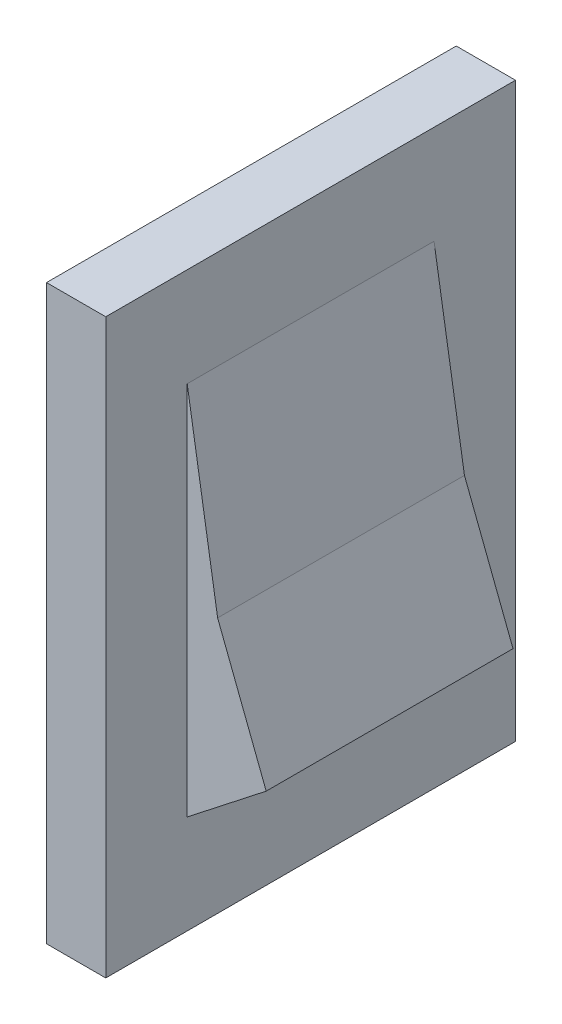
ISO-10303-21;
HEADER;
FILE_DESCRIPTION(('STEP AP214'),'2;1');
FILE_NAME('part.step','',(''),(''),'','','');
FILE_SCHEMA(('AUTOMOTIVE_DESIGN { 1 0 10303 214 1 1 1 1 }'));
ENDSEC;
DATA;
#1=APPLICATION_CONTEXT('core data for automotive mechanical design processes');
#2=APPLICATION_PROTOCOL_DEFINITION('international standard','automotive_design',2000,#1);
#3=PRODUCT_CONTEXT('',#1,'mechanical');
#4=PRODUCT('Part','Part','',(#3));
#5=PRODUCT_RELATED_PRODUCT_CATEGORY('part','',(#4));
#6=PRODUCT_DEFINITION_FORMATION('','',#4);
#7=PRODUCT_DEFINITION_CONTEXT('part definition',#1,'design');
#8=PRODUCT_DEFINITION('design','',#6,#7);
#9=PRODUCT_DEFINITION_SHAPE('','',#8);
#10=(LENGTH_UNIT() NAMED_UNIT(*) SI_UNIT(.MILLI.,.METRE.));
#11=(NAMED_UNIT(*) PLANE_ANGLE_UNIT() SI_UNIT($,.RADIAN.));
#12=(NAMED_UNIT(*) SI_UNIT($,.STERADIAN.) SOLID_ANGLE_UNIT());
#13=UNCERTAINTY_MEASURE_WITH_UNIT(LENGTH_MEASURE(1.E-05),#10,'distance_accuracy_value','');
#14=(GEOMETRIC_REPRESENTATION_CONTEXT(3) GLOBAL_UNCERTAINTY_ASSIGNED_CONTEXT((#13)) GLOBAL_UNIT_ASSIGNED_CONTEXT((#10,
#11,#12)) REPRESENTATION_CONTEXT('',''));
#15=CARTESIAN_POINT('',(0.,0.,0.));
#16=DIRECTION('',(0.,0.,1.));
#17=DIRECTION('',(1.,0.,0.));
#18=AXIS2_PLACEMENT_3D('',#15,#16,#17);
#19=CARTESIAN_POINT('',(1.524,0.,0.));
#20=DIRECTION('',(-1.,0.,0.));
#21=DIRECTION('',(0.,0.,1.));
#22=AXIS2_PLACEMENT_3D('',#19,#20,#21);
#23=PLANE('',#22);
#24=DIRECTION('',(0.,1.,0.));
#25=VECTOR('',#24,1.);
#26=CARTESIAN_POINT('',(1.524,-7.366,-5.2705));
#27=LINE('',#26,#25);
#28=CARTESIAN_POINT('',(1.524,-7.366,-5.2705));
#29=VERTEX_POINT('',#28);
#30=CARTESIAN_POINT('',(1.524,7.366,-5.2705));
#31=VERTEX_POINT('',#30);
#32=EDGE_CURVE('E133',#29,#31,#27,.T.);
#33=ORIENTED_EDGE('',*,*,#32,.T.);
#34=DIRECTION('',(0.,0.,1.));
#35=VECTOR('',#34,1.);
#36=CARTESIAN_POINT('',(1.524,7.366,5.2705));
#37=LINE('',#36,#35);
#38=CARTESIAN_POINT('',(1.524,7.366,5.2705));
#39=VERTEX_POINT('',#38);
#40=EDGE_CURVE('E84',#31,#39,#37,.T.);
#41=ORIENTED_EDGE('',*,*,#40,.T.);
#42=DIRECTION('',(0.,-1.,0.));
#43=VECTOR('',#42,1.);
#44=CARTESIAN_POINT('',(1.524,-7.366,5.2705));
#45=LINE('',#44,#43);
#46=CARTESIAN_POINT('',(1.524,-7.366,5.2705));
#47=VERTEX_POINT('',#46);
#48=EDGE_CURVE('E136',#39,#47,#45,.T.);
#49=ORIENTED_EDGE('',*,*,#48,.T.);
#50=DIRECTION('',(0.,0.,-1.));
#51=VECTOR('',#50,1.);
#52=CARTESIAN_POINT('',(1.524,-7.366,5.2705));
#53=LINE('',#52,#51);
#54=EDGE_CURVE('E56',#47,#29,#53,.T.);
#55=ORIENTED_EDGE('',*,*,#54,.T.);
#56=EDGE_LOOP('',(#33,#41,#49,#55));
#57=FACE_BOUND('',#56,.T.);
#58=DIRECTION('',(0.,1.,0.));
#59=VECTOR('',#58,1.);
#60=CARTESIAN_POINT('',(1.524,-4.826,-3.175));
#61=LINE('',#60,#59);
#62=CARTESIAN_POINT('',(1.524,-4.826,-3.175));
#63=VERTEX_POINT('',#62);
#64=CARTESIAN_POINT('',(1.524,4.826,-3.175));
#65=VERTEX_POINT('',#64);
#66=EDGE_CURVE('E119',#63,#65,#61,.T.);
#67=ORIENTED_EDGE('',*,*,#66,.F.);
#68=DIRECTION('',(0.,0.,-1.));
#69=VECTOR('',#68,1.);
#70=CARTESIAN_POINT('',(1.524,-4.826,3.175));
#71=LINE('',#70,#69);
#72=CARTESIAN_POINT('',(1.524,-4.826,3.175));
#73=VERTEX_POINT('',#72);
#74=EDGE_CURVE('E127',#73,#63,#71,.T.);
#75=ORIENTED_EDGE('',*,*,#74,.F.);
#76=DIRECTION('',(0.,-1.,0.));
#77=VECTOR('',#76,1.);
#78=CARTESIAN_POINT('',(1.524,-4.826,3.175));
#79=LINE('',#78,#77);
#80=CARTESIAN_POINT('',(1.524,4.826,3.175));
#81=VERTEX_POINT('',#80);
#82=EDGE_CURVE('E118',#81,#73,#79,.T.);
#83=ORIENTED_EDGE('',*,*,#82,.F.);
#84=DIRECTION('',(0.,0.,1.));
#85=VECTOR('',#84,1.);
#86=CARTESIAN_POINT('',(1.524,4.826,3.175));
#87=LINE('',#86,#85);
#88=EDGE_CURVE('E106',#65,#81,#87,.T.);
#89=ORIENTED_EDGE('',*,*,#88,.F.);
#90=EDGE_LOOP('',(#67,#75,#83,#89));
#91=FACE_BOUND('',#90,.T.);
#92=ADVANCED_FACE('F32',(#57,#91),#23,.F.);
#93=CARTESIAN_POINT('',(1.524,-7.366,-5.2705));
#94=DIRECTION('',(0.,0.,1.));
#95=DIRECTION('',(1.,0.,0.));
#96=AXIS2_PLACEMENT_3D('',#93,#94,#95);
#97=PLANE('',#96);
#98=DIRECTION('',(0.,1.,0.));
#99=VECTOR('',#98,1.);
#100=CARTESIAN_POINT('',(0.,-7.366,-5.2705));
#101=LINE('',#100,#99);
#102=CARTESIAN_POINT('',(0.,-7.366,-5.2705));
#103=VERTEX_POINT('',#102);
#104=CARTESIAN_POINT('',(0.,7.366,-5.2705));
#105=VERTEX_POINT('',#104);
#106=EDGE_CURVE('E129',#103,#105,#101,.T.);
#107=ORIENTED_EDGE('',*,*,#106,.T.);
#108=DIRECTION('',(-1.,0.,0.));
#109=VECTOR('',#108,1.);
#110=CARTESIAN_POINT('',(1.524,7.366,-5.2705));
#111=LINE('',#110,#109);
#112=EDGE_CURVE('E11',#31,#105,#111,.T.);
#113=ORIENTED_EDGE('',*,*,#112,.F.);
#114=ORIENTED_EDGE('',*,*,#32,.F.);
#115=DIRECTION('',(-1.,0.,0.));
#116=VECTOR('',#115,1.);
#117=CARTESIAN_POINT('',(1.524,-7.366,-5.2705));
#118=LINE('',#117,#116);
#119=EDGE_CURVE('E139',#29,#103,#118,.T.);
#120=ORIENTED_EDGE('',*,*,#119,.T.);
#121=EDGE_LOOP('',(#107,#113,#114,#120));
#122=FACE_BOUND('',#121,.T.);
#123=ADVANCED_FACE('F34',(#122),#97,.F.);
#124=CARTESIAN_POINT('',(1.524,7.366,5.2705));
#125=DIRECTION('',(0.,-1.,0.));
#126=DIRECTION('',(0.,0.,-1.));
#127=AXIS2_PLACEMENT_3D('',#124,#125,#126);
#128=PLANE('',#127);
#129=DIRECTION('',(0.,0.,1.));
#130=VECTOR('',#129,1.);
#131=CARTESIAN_POINT('',(0.,7.366,5.2705));
#132=LINE('',#131,#130);
#133=CARTESIAN_POINT('',(0.,7.366,5.2705));
#134=VERTEX_POINT('',#133);
#135=EDGE_CURVE('E142',#105,#134,#132,.T.);
#136=ORIENTED_EDGE('',*,*,#135,.T.);
#137=DIRECTION('',(-1.,0.,0.));
#138=VECTOR('',#137,1.);
#139=CARTESIAN_POINT('',(1.524,7.366,5.2705));
#140=LINE('',#139,#138);
#141=EDGE_CURVE('E40',#39,#134,#140,.T.);
#142=ORIENTED_EDGE('',*,*,#141,.F.);
#143=ORIENTED_EDGE('',*,*,#40,.F.);
#144=ORIENTED_EDGE('',*,*,#112,.T.);
#145=EDGE_LOOP('',(#136,#142,#143,#144));
#146=FACE_BOUND('',#145,.T.);
#147=ADVANCED_FACE('F170',(#146),#128,.F.);
#148=CARTESIAN_POINT('',(1.524,-7.366,5.2705));
#149=DIRECTION('',(0.,0.,-1.));
#150=DIRECTION('',(-1.,0.,0.));
#151=AXIS2_PLACEMENT_3D('',#148,#149,#150);
#152=PLANE('',#151);
#153=DIRECTION('',(0.,-1.,0.));
#154=VECTOR('',#153,1.);
#155=CARTESIAN_POINT('',(0.,-7.366,5.2705));
#156=LINE('',#155,#154);
#157=CARTESIAN_POINT('',(0.,-7.366,5.2705));
#158=VERTEX_POINT('',#157);
#159=EDGE_CURVE('E144',#134,#158,#156,.T.);
#160=ORIENTED_EDGE('',*,*,#159,.T.);
#161=DIRECTION('',(-1.,0.,0.));
#162=VECTOR('',#161,1.);
#163=CARTESIAN_POINT('',(1.524,-7.366,5.2705));
#164=LINE('',#163,#162);
#165=EDGE_CURVE('E148',#47,#158,#164,.T.);
#166=ORIENTED_EDGE('',*,*,#165,.F.);
#167=ORIENTED_EDGE('',*,*,#48,.F.);
#168=ORIENTED_EDGE('',*,*,#141,.T.);
#169=EDGE_LOOP('',(#160,#166,#167,#168));
#170=FACE_BOUND('',#169,.T.);
#171=ADVANCED_FACE('F153',(#170),#152,.F.);
#172=CARTESIAN_POINT('',(1.524,-7.366,5.2705));
#173=DIRECTION('',(0.,1.,0.));
#174=DIRECTION('',(0.,0.,1.));
#175=AXIS2_PLACEMENT_3D('',#172,#173,#174);
#176=PLANE('',#175);
#177=DIRECTION('',(0.,0.,-1.));
#178=VECTOR('',#177,1.);
#179=CARTESIAN_POINT('',(0.,-7.366,5.2705));
#180=LINE('',#179,#178);
#181=EDGE_CURVE('E77',#158,#103,#180,.T.);
#182=ORIENTED_EDGE('',*,*,#181,.T.);
#183=ORIENTED_EDGE('',*,*,#119,.F.);
#184=ORIENTED_EDGE('',*,*,#54,.F.);
#185=ORIENTED_EDGE('',*,*,#165,.T.);
#186=EDGE_LOOP('',(#182,#183,#184,#185));
#187=FACE_BOUND('',#186,.T.);
#188=ADVANCED_FACE('F161',(#187),#176,.F.);
#189=CARTESIAN_POINT('',(0.,0.,0.));
#190=DIRECTION('',(-1.,0.,0.));
#191=DIRECTION('',(0.,0.,1.));
#192=AXIS2_PLACEMENT_3D('',#189,#190,#191);
#193=PLANE('',#192);
#194=ORIENTED_EDGE('',*,*,#106,.F.);
#195=ORIENTED_EDGE('',*,*,#181,.F.);
#196=ORIENTED_EDGE('',*,*,#159,.F.);
#197=ORIENTED_EDGE('',*,*,#135,.F.);
#198=EDGE_LOOP('',(#194,#195,#196,#197));
#199=FACE_BOUND('',#198,.T.);
#200=ADVANCED_FACE('F157',(#199),#193,.T.);
#201=CARTESIAN_POINT('',(3.556,-4.826,-3.175));
#202=DIRECTION('',(0.,0.,1.));
#203=DIRECTION('',(1.,0.,0.));
#204=AXIS2_PLACEMENT_3D('',#201,#202,#203);
#205=PLANE('',#204);
#206=DIRECTION('',(-0.360283256506923,0.932842953063787,0.));
#207=VECTOR('',#206,1.);
#208=CARTESIAN_POINT('',(3.556,-3.23481624314164,-3.175));
#209=LINE('',#208,#207);
#210=CARTESIAN_POINT('',(3.556,-3.23481624314164,-3.175));
#211=VERTEX_POINT('',#210);
#212=CARTESIAN_POINT('',(2.30664701249786,0.,-3.175));
#213=VERTEX_POINT('',#212);
#214=EDGE_CURVE('E198',#211,#213,#209,.T.);
#215=ORIENTED_EDGE('',*,*,#214,.F.);
#216=DIRECTION('',(0.78733141609235,0.616530000270883,0.));
#217=VECTOR('',#216,1.);
#218=CARTESIAN_POINT('',(1.524,-4.826,-3.175));
#219=LINE('',#218,#217);
#220=EDGE_CURVE('E194',#63,#211,#219,.T.);
#221=ORIENTED_EDGE('',*,*,#220,.F.);
#222=ORIENTED_EDGE('',*,*,#66,.T.);
#223=DIRECTION('',(-0.160081605320344,0.987103783620578,0.));
#224=VECTOR('',#223,1.);
#225=CARTESIAN_POINT('',(2.30664701249786,0.,-3.175));
#226=LINE('',#225,#224);
#227=EDGE_CURVE('E113',#213,#65,#226,.T.);
#228=ORIENTED_EDGE('',*,*,#227,.F.);
#229=EDGE_LOOP('',(#215,#221,#222,#228));
#230=FACE_BOUND('',#229,.T.);
#231=ADVANCED_FACE('F168',(#230),#205,.F.);
#232=CARTESIAN_POINT('',(3.556,-4.826,3.175));
#233=DIRECTION('',(0.,0.,-1.));
#234=DIRECTION('',(-1.,0.,0.));
#235=AXIS2_PLACEMENT_3D('',#232,#233,#234);
#236=PLANE('',#235);
#237=ORIENTED_EDGE('',*,*,#82,.T.);
#238=DIRECTION('',(-0.78733141609235,-0.616530000270883,0.));
#239=VECTOR('',#238,1.);
#240=CARTESIAN_POINT('',(1.524,-4.826,3.175));
#241=LINE('',#240,#239);
#242=CARTESIAN_POINT('',(3.556,-3.23481624314164,3.175));
#243=VERTEX_POINT('',#242);
#244=EDGE_CURVE('E47',#243,#73,#241,.T.);
#245=ORIENTED_EDGE('',*,*,#244,.F.);
#246=DIRECTION('',(0.360283256506923,-0.932842953063787,0.));
#247=VECTOR('',#246,1.);
#248=CARTESIAN_POINT('',(3.556,-3.23481624314164,3.175));
#249=LINE('',#248,#247);
#250=CARTESIAN_POINT('',(2.30664701249786,0.,3.175));
#251=VERTEX_POINT('',#250);
#252=EDGE_CURVE('E125',#251,#243,#249,.T.);
#253=ORIENTED_EDGE('',*,*,#252,.F.);
#254=DIRECTION('',(0.160081605320344,-0.987103783620578,0.));
#255=VECTOR('',#254,1.);
#256=CARTESIAN_POINT('',(2.30664701249786,0.,3.175));
#257=LINE('',#256,#255);
#258=EDGE_CURVE('E110',#81,#251,#257,.T.);
#259=ORIENTED_EDGE('',*,*,#258,.F.);
#260=EDGE_LOOP('',(#237,#245,#253,#259));
#261=FACE_BOUND('',#260,.T.);
#262=ADVANCED_FACE('F123',(#261),#236,.F.);
#263=CARTESIAN_POINT('',(1.524,-4.826,-13.3755487438404));
#264=DIRECTION('',(-0.616530000270883,0.78733141609235,0.));
#265=DIRECTION('',(-0.78733141609235,-0.616530000270883,0.));
#266=AXIS2_PLACEMENT_3D('',#263,#264,#265);
#267=PLANE('',#266);
#268=ORIENTED_EDGE('',*,*,#220,.T.);
#269=DIRECTION('',(0.,0.,1.));
#270=VECTOR('',#269,1.);
#271=CARTESIAN_POINT('',(3.556,-3.23481624314164,-13.3755487438404));
#272=LINE('',#271,#270);
#273=EDGE_CURVE('E196',#211,#243,#272,.T.);
#274=ORIENTED_EDGE('',*,*,#273,.T.);
#275=ORIENTED_EDGE('',*,*,#244,.T.);
#276=ORIENTED_EDGE('',*,*,#74,.T.);
#277=EDGE_LOOP('',(#268,#274,#275,#276));
#278=FACE_BOUND('',#277,.T.);
#279=ADVANCED_FACE('F183',(#278),#267,.F.);
#280=CARTESIAN_POINT('',(3.556,-3.23481624314164,-13.3755487438404));
#281=DIRECTION('',(-0.932842953063787,-0.360283256506923,0.));
#282=DIRECTION('',(0.360283256506923,-0.932842953063787,0.));
#283=AXIS2_PLACEMENT_3D('',#280,#281,#282);
#284=PLANE('',#283);
#285=ORIENTED_EDGE('',*,*,#214,.T.);
#286=DIRECTION('',(0.,0.,1.));
#287=VECTOR('',#286,1.);
#288=CARTESIAN_POINT('',(2.30664701249786,0.,-13.3755487438404));
#289=LINE('',#288,#287);
#290=EDGE_CURVE('E200',#213,#251,#289,.T.);
#291=ORIENTED_EDGE('',*,*,#290,.T.);
#292=ORIENTED_EDGE('',*,*,#252,.T.);
#293=ORIENTED_EDGE('',*,*,#273,.F.);
#294=EDGE_LOOP('',(#285,#291,#292,#293));
#295=FACE_BOUND('',#294,.T.);
#296=ADVANCED_FACE('F186',(#295),#284,.F.);
#297=CARTESIAN_POINT('',(2.30664701249786,0.,-13.3755487438404));
#298=DIRECTION('',(-0.987103783620578,-0.160081605320344,0.));
#299=DIRECTION('',(0.160081605320344,-0.987103783620578,0.));
#300=AXIS2_PLACEMENT_3D('',#297,#298,#299);
#301=PLANE('',#300);
#302=ORIENTED_EDGE('',*,*,#227,.T.);
#303=ORIENTED_EDGE('',*,*,#88,.T.);
#304=ORIENTED_EDGE('',*,*,#258,.T.);
#305=ORIENTED_EDGE('',*,*,#290,.F.);
#306=EDGE_LOOP('',(#302,#303,#304,#305));
#307=FACE_BOUND('',#306,.T.);
#308=ADVANCED_FACE('F108',(#307),#301,.F.);
#309=CLOSED_SHELL('',(#92,#123,#147,#171,#188,#200,#231,#262,#279,#296,#308));
#310=MANIFOLD_SOLID_BREP('B2',#309);
#311=ADVANCED_BREP_SHAPE_REPRESENTATION('',(#18,#310),#14);
#312=SHAPE_DEFINITION_REPRESENTATION(#9,#311);
ENDSEC;
END-ISO-10303-21;
